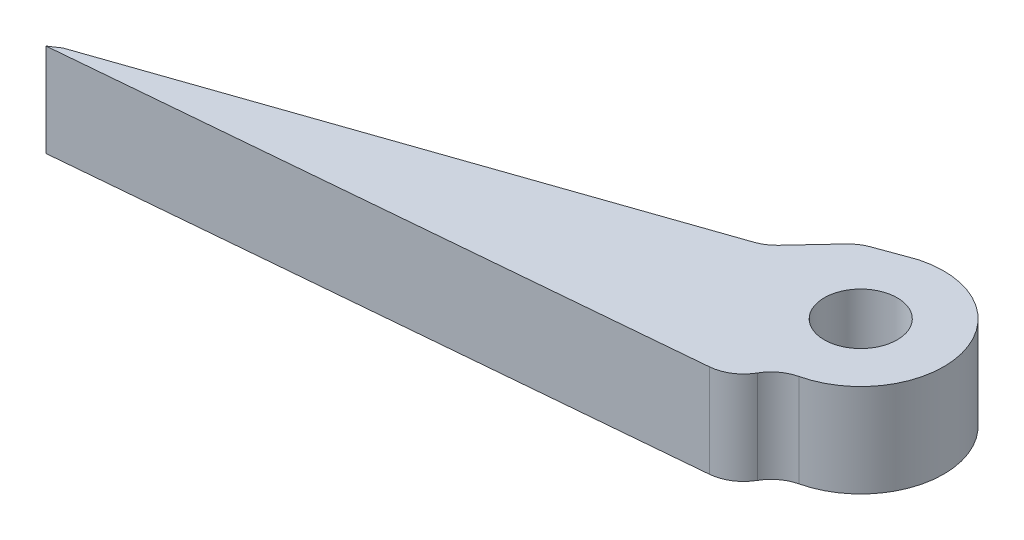
ISO-10303-21;
HEADER;
FILE_DESCRIPTION(('STEP AP214'),'2;1');
FILE_NAME('part.step','',(''),(''),'','','');
FILE_SCHEMA(('AUTOMOTIVE_DESIGN { 1 0 10303 214 1 1 1 1 }'));
ENDSEC;
DATA;
#1=APPLICATION_CONTEXT('core data for automotive mechanical design processes');
#2=APPLICATION_PROTOCOL_DEFINITION('international standard','automotive_design',2000,#1);
#3=PRODUCT_CONTEXT('',#1,'mechanical');
#4=PRODUCT('Part','Part','',(#3));
#5=PRODUCT_RELATED_PRODUCT_CATEGORY('part','',(#4));
#6=PRODUCT_DEFINITION_FORMATION('','',#4);
#7=PRODUCT_DEFINITION_CONTEXT('part definition',#1,'design');
#8=PRODUCT_DEFINITION('design','',#6,#7);
#9=PRODUCT_DEFINITION_SHAPE('','',#8);
#10=(LENGTH_UNIT() NAMED_UNIT(*) SI_UNIT(.MILLI.,.METRE.));
#11=(NAMED_UNIT(*) PLANE_ANGLE_UNIT() SI_UNIT($,.RADIAN.));
#12=(NAMED_UNIT(*) SI_UNIT($,.STERADIAN.) SOLID_ANGLE_UNIT());
#13=UNCERTAINTY_MEASURE_WITH_UNIT(LENGTH_MEASURE(1.E-05),#10,'distance_accuracy_value','');
#14=(GEOMETRIC_REPRESENTATION_CONTEXT(3) GLOBAL_UNCERTAINTY_ASSIGNED_CONTEXT((#13)) GLOBAL_UNIT_ASSIGNED_CONTEXT((#10,
#11,#12)) REPRESENTATION_CONTEXT('',''));
#15=CARTESIAN_POINT('',(0.,0.,0.));
#16=DIRECTION('',(0.,0.,1.));
#17=DIRECTION('',(1.,0.,0.));
#18=AXIS2_PLACEMENT_3D('',#15,#16,#17);
#19=CARTESIAN_POINT('',(0.,6.35,0.));
#20=DIRECTION('',(0.,-1.,0.));
#21=DIRECTION('',(0.,0.,-1.));
#22=AXIS2_PLACEMENT_3D('',#19,#20,#21);
#23=CYLINDRICAL_SURFACE('',#22,5.6642);
#24=CARTESIAN_POINT('',(0.,6.35,0.));
#25=DIRECTION('',(0.,1.,0.));
#26=DIRECTION('',(0.,0.,1.));
#27=AXIS2_PLACEMENT_3D('',#24,#25,#26);
#28=CIRCLE('',#27,5.6642);
#29=CARTESIAN_POINT('',(1.29689508505912,6.35,5.51373056816793));
#30=VERTEX_POINT('',#29);
#31=CARTESIAN_POINT('',(-1.48078407813982,6.35,-5.46721502722616));
#32=VERTEX_POINT('',#31);
#33=EDGE_CURVE('E173',#30,#32,#28,.T.);
#34=ORIENTED_EDGE('',*,*,#33,.F.);
#35=DIRECTION('',(0.,-1.,0.));
#36=VECTOR('',#35,1.);
#37=CARTESIAN_POINT('',(1.29689508505912,6.35,5.51373056816793));
#38=LINE('',#37,#36);
#39=CARTESIAN_POINT('',(1.29689508505912,0.,5.51373056816793));
#40=VERTEX_POINT('',#39);
#41=EDGE_CURVE('E207',#30,#40,#38,.T.);
#42=ORIENTED_EDGE('',*,*,#41,.T.);
#43=CARTESIAN_POINT('',(0.,0.,0.));
#44=DIRECTION('',(0.,1.,0.));
#45=DIRECTION('',(0.,0.,1.));
#46=AXIS2_PLACEMENT_3D('',#43,#44,#45);
#47=CIRCLE('',#46,5.6642);
#48=CARTESIAN_POINT('',(-1.48078407813982,0.,-5.46721502722616));
#49=VERTEX_POINT('',#48);
#50=EDGE_CURVE('E156',#40,#49,#47,.T.);
#51=ORIENTED_EDGE('',*,*,#50,.T.);
#52=DIRECTION('',(0.,-1.,0.));
#53=VECTOR('',#52,1.);
#54=CARTESIAN_POINT('',(-1.48078407813982,6.35,-5.46721502722616));
#55=LINE('',#54,#53);
#56=EDGE_CURVE('E194',#49,#32,#55,.F.);
#57=ORIENTED_EDGE('',*,*,#56,.T.);
#58=EDGE_LOOP('',(#34,#42,#51,#57));
#59=FACE_BOUND('',#58,.T.);
#60=ADVANCED_FACE('F38',(#59),#23,.T.);
#61=CARTESIAN_POINT('',(-1.93832585993717,6.35,-5.31007611663692));
#62=DIRECTION('',(0.342897302873058,0.,0.939372897034177));
#63=DIRECTION('',(0.939372897034177,0.,-0.342897302873058));
#64=AXIS2_PLACEMENT_3D('',#61,#62,#63);
#65=PLANE('',#64);
#66=DIRECTION('',(-0.939372897034177,0.,0.342897302873058));
#67=VECTOR('',#66,1.);
#68=CARTESIAN_POINT('',(-1.93832585993717,6.35,-5.31007611663692));
#69=LINE('',#68,#67);
#70=CARTESIAN_POINT('',(-1.68771449284554,6.35,-5.40155625420142));
#71=VERTEX_POINT('',#70);
#72=CARTESIAN_POINT('',(-3.93136501602205,6.35,-4.58256124655755));
#73=VERTEX_POINT('',#72);
#74=EDGE_CURVE('E225',#71,#73,#69,.T.);
#75=ORIENTED_EDGE('',*,*,#74,.F.);
#76=DIRECTION('',(0.,-1.,0.));
#77=VECTOR('',#76,1.);
#78=CARTESIAN_POINT('',(-1.68771449284554,6.35,-5.40155625420142));
#79=LINE('',#78,#77);
#80=CARTESIAN_POINT('',(-1.68771449284554,0.,-5.40155625420142));
#81=VERTEX_POINT('',#80);
#82=EDGE_CURVE('E191',#71,#81,#79,.T.);
#83=ORIENTED_EDGE('',*,*,#82,.T.);
#84=DIRECTION('',(-0.939372897034177,0.,0.342897302873058));
#85=VECTOR('',#84,1.);
#86=CARTESIAN_POINT('',(-1.93832585993717,0.,-5.31007611663692));
#87=LINE('',#86,#85);
#88=CARTESIAN_POINT('',(-3.93136501602205,0.,-4.58256124655755));
#89=VERTEX_POINT('',#88);
#90=EDGE_CURVE('E158',#81,#89,#87,.T.);
#91=ORIENTED_EDGE('',*,*,#90,.T.);
#92=DIRECTION('',(0.,-1.,0.));
#93=VECTOR('',#92,1.);
#94=CARTESIAN_POINT('',(-3.93136501602205,6.35,-4.58256124655755));
#95=LINE('',#94,#93);
#96=EDGE_CURVE('E189',#89,#73,#95,.F.);
#97=ORIENTED_EDGE('',*,*,#96,.T.);
#98=EDGE_LOOP('',(#75,#83,#91,#97));
#99=FACE_BOUND('',#98,.T.);
#100=ADVANCED_FACE('F228',(#99),#65,.F.);
#101=CARTESIAN_POINT('',(-4.58967507965529,6.35,-4.28088514702107));
#102=DIRECTION('',(0.731278684400195,0.,0.682078797311514));
#103=DIRECTION('',(0.682078797311514,0.,-0.731278684400195));
#104=AXIS2_PLACEMENT_3D('',#101,#102,#103);
#105=PLANE('',#104);
#106=DIRECTION('',(-0.682078797311514,0.,0.731278684400195));
#107=VECTOR('',#106,1.);
#108=CARTESIAN_POINT('',(-4.58967507965529,6.35,-4.28088514702107));
#109=LINE('',#108,#107);
#110=CARTESIAN_POINT('',(-4.91785372510097,6.35,-3.92903423326198));
#111=VERTEX_POINT('',#110);
#112=CARTESIAN_POINT('',(-7.13490656472734,6.35,-1.55206035546642));
#113=VERTEX_POINT('',#112);
#114=EDGE_CURVE('E133',#111,#113,#109,.T.);
#115=ORIENTED_EDGE('',*,*,#114,.F.);
#116=DIRECTION('',(0.,-1.,0.));
#117=VECTOR('',#116,1.);
#118=CARTESIAN_POINT('',(-4.91785372510097,6.35,-3.92903423326198));
#119=LINE('',#118,#117);
#120=CARTESIAN_POINT('',(-4.91785372510097,0.,-3.92903423326198));
#121=VERTEX_POINT('',#120);
#122=EDGE_CURVE('E199',#111,#121,#119,.T.);
#123=ORIENTED_EDGE('',*,*,#122,.T.);
#124=DIRECTION('',(-0.682078797311514,0.,0.731278684400195));
#125=VECTOR('',#124,1.);
#126=CARTESIAN_POINT('',(-4.58967507965529,0.,-4.28088514702107));
#127=LINE('',#126,#125);
#128=CARTESIAN_POINT('',(-7.13490656472734,0.,-1.55206035546642));
#129=VERTEX_POINT('',#128);
#130=EDGE_CURVE('E161',#121,#129,#127,.T.);
#131=ORIENTED_EDGE('',*,*,#130,.T.);
#132=DIRECTION('',(0.,-1.,0.));
#133=VECTOR('',#132,1.);
#134=CARTESIAN_POINT('',(-7.13490656472734,6.35,-1.55206035546642));
#135=LINE('',#134,#133);
#136=EDGE_CURVE('E197',#129,#113,#135,.F.);
#137=ORIENTED_EDGE('',*,*,#136,.T.);
#138=EDGE_LOOP('',(#115,#123,#131,#137));
#139=FACE_BOUND('',#138,.T.);
#140=ADVANCED_FACE('F254',(#139),#105,.F.);
#141=CARTESIAN_POINT('',(-1.14127849340694,6.35,-3.3070118596416));
#142=DIRECTION('',(0.326228149845985,0.,0.945291063243521));
#143=DIRECTION('',(0.945291063243521,0.,-0.326228149845985));
#144=AXIS2_PLACEMENT_3D('',#141,#142,#143);
#145=PLANE('',#144);
#146=DIRECTION('',(-0.945291063243521,0.,0.326228149845985));
#147=VECTOR('',#146,1.);
#148=CARTESIAN_POINT('',(-1.14127849340694,6.35,-3.3070118596416));
#149=LINE('',#148,#147);
#150=CARTESIAN_POINT('',(-8.16373492249503,6.35,-0.88350119999912));
#151=VERTEX_POINT('',#150);
#152=CARTESIAN_POINT('',(-43.2087752257035,6.35,11.2108463548856));
#153=VERTEX_POINT('',#152);
#154=EDGE_CURVE('E119',#151,#153,#149,.T.);
#155=ORIENTED_EDGE('',*,*,#154,.F.);
#156=DIRECTION('',(0.,-1.,0.));
#157=VECTOR('',#156,1.);
#158=CARTESIAN_POINT('',(-8.16373492249503,0.,-0.883501199999119));
#159=LINE('',#158,#157);
#160=CARTESIAN_POINT('',(-8.16373492249503,0.,-0.88350119999912));
#161=VERTEX_POINT('',#160);
#162=EDGE_CURVE('E202',#151,#161,#159,.T.);
#163=ORIENTED_EDGE('',*,*,#162,.T.);
#164=DIRECTION('',(-0.945291063243521,0.,0.326228149845985));
#165=VECTOR('',#164,1.);
#166=CARTESIAN_POINT('',(-1.14127849340694,0.,-3.3070118596416));
#167=LINE('',#166,#165);
#168=CARTESIAN_POINT('',(-43.2087752257035,0.,11.2108463548856));
#169=VERTEX_POINT('',#168);
#170=EDGE_CURVE('E139',#161,#169,#167,.T.);
#171=ORIENTED_EDGE('',*,*,#170,.T.);
#172=DIRECTION('',(0.,-1.,0.));
#173=VECTOR('',#172,1.);
#174=CARTESIAN_POINT('',(-43.2087752257035,6.35,11.2108463548856));
#175=LINE('',#174,#173);
#176=EDGE_CURVE('E136',#153,#169,#175,.T.);
#177=ORIENTED_EDGE('',*,*,#176,.F.);
#178=EDGE_LOOP('',(#155,#163,#171,#177));
#179=FACE_BOUND('',#178,.T.);
#180=ADVANCED_FACE('F137',(#179),#145,.F.);
#181=CARTESIAN_POINT('',(-8.12479474790291,6.35,-12.1842060856918));
#182=DIRECTION('',(0.554794299812511,0.,0.831987550925821));
#183=DIRECTION('',(0.831987550925821,0.,-0.554794299812511));
#184=AXIS2_PLACEMENT_3D('',#181,#182,#183);
#185=PLANE('',#184);
#186=DIRECTION('',(-0.831987550925821,0.,0.554794299812511));
#187=VECTOR('',#186,1.);
#188=CARTESIAN_POINT('',(-8.12479474790291,0.,-12.1842060856918));
#189=LINE('',#188,#187);
#190=CARTESIAN_POINT('',(-43.9079976591394,0.,11.6771088848232));
#191=VERTEX_POINT('',#190);
#192=EDGE_CURVE('E165',#169,#191,#189,.T.);
#193=ORIENTED_EDGE('',*,*,#192,.T.);
#194=DIRECTION('',(0.,-1.,0.));
#195=VECTOR('',#194,1.);
#196=CARTESIAN_POINT('',(-43.9079976591394,6.35,11.6771088848232));
#197=LINE('',#196,#195);
#198=CARTESIAN_POINT('',(-43.9079976591394,6.35,11.6771088848232));
#199=VERTEX_POINT('',#198);
#200=EDGE_CURVE('E143',#199,#191,#197,.T.);
#201=ORIENTED_EDGE('',*,*,#200,.F.);
#202=DIRECTION('',(-0.831987550925821,0.,0.554794299812511));
#203=VECTOR('',#202,1.);
#204=CARTESIAN_POINT('',(-8.12479474790291,6.35,-12.1842060856918));
#205=LINE('',#204,#203);
#206=EDGE_CURVE('E125',#153,#199,#205,.T.);
#207=ORIENTED_EDGE('',*,*,#206,.F.);
#208=ORIENTED_EDGE('',*,*,#176,.T.);
#209=EDGE_LOOP('',(#193,#201,#207,#208));
#210=FACE_BOUND('',#209,.T.);
#211=ADVANCED_FACE('F145',(#210),#185,.F.);
#212=CARTESIAN_POINT('',(0.684121339297338,6.35,7.73125035187185));
#213=DIRECTION('',(-0.0881433880829443,0.,-0.996107796946324));
#214=DIRECTION('',(-0.996107796946324,0.,0.0881433880829443));
#215=AXIS2_PLACEMENT_3D('',#212,#213,#214);
#216=PLANE('',#215);
#217=DIRECTION('',(0.996107796946324,0.,-0.0881433880829443));
#218=VECTOR('',#217,1.);
#219=CARTESIAN_POINT('',(0.684121339297338,0.,7.73125035187185));
#220=LINE('',#219,#218);
#221=CARTESIAN_POINT('',(-2.30836599064848,0.,7.99604897393396));
#222=VERTEX_POINT('',#221);
#223=EDGE_CURVE('E167',#191,#222,#220,.T.);
#224=ORIENTED_EDGE('',*,*,#223,.T.);
#225=DIRECTION('',(0.,-1.,0.));
#226=VECTOR('',#225,1.);
#227=CARTESIAN_POINT('',(-2.30836599064848,6.35,7.99604897393396));
#228=LINE('',#227,#226);
#229=CARTESIAN_POINT('',(-2.30836599064848,6.35,7.99604897393396));
#230=VERTEX_POINT('',#229);
#231=EDGE_CURVE('E181',#222,#230,#228,.F.);
#232=ORIENTED_EDGE('',*,*,#231,.T.);
#233=DIRECTION('',(0.996107796946324,0.,-0.0881433880829443));
#234=VECTOR('',#233,1.);
#235=CARTESIAN_POINT('',(0.684121339297338,6.35,7.73125035187185));
#236=LINE('',#235,#234);
#237=EDGE_CURVE('E148',#199,#230,#236,.T.);
#238=ORIENTED_EDGE('',*,*,#237,.F.);
#239=ORIENTED_EDGE('',*,*,#200,.T.);
#240=EDGE_LOOP('',(#224,#232,#238,#239));
#241=FACE_BOUND('',#240,.T.);
#242=ADVANCED_FACE('F241',(#241),#216,.F.);
#243=CARTESIAN_POINT('',(0.,6.35,0.));
#244=DIRECTION('',(0.,-1.,0.));
#245=DIRECTION('',(0.,0.,-1.));
#246=AXIS2_PLACEMENT_3D('',#243,#244,#245);
#247=CYLINDRICAL_SURFACE('',#246,2.4892);
#248=CARTESIAN_POINT('',(0.,6.35,0.));
#249=DIRECTION('',(0.,1.,0.));
#250=DIRECTION('',(0.,0.,1.));
#251=AXIS2_PLACEMENT_3D('',#248,#249,#250);
#252=CIRCLE('',#251,2.4892);
#253=CARTESIAN_POINT('',(0.,6.35,2.4892));
#254=VERTEX_POINT('',#253);
#255=EDGE_CURVE('E150',#254,#254,#252,.T.);
#256=ORIENTED_EDGE('',*,*,#255,.T.);
#257=EDGE_LOOP('',(#256));
#258=FACE_BOUND('',#257,.T.);
#259=CARTESIAN_POINT('',(0.,0.,0.));
#260=DIRECTION('',(0.,1.,0.));
#261=DIRECTION('',(0.,0.,1.));
#262=AXIS2_PLACEMENT_3D('',#259,#260,#261);
#263=CIRCLE('',#262,2.4892);
#264=CARTESIAN_POINT('',(0.,0.,2.4892));
#265=VERTEX_POINT('',#264);
#266=EDGE_CURVE('E170',#265,#265,#263,.T.);
#267=ORIENTED_EDGE('',*,*,#266,.F.);
#268=EDGE_LOOP('',(#267));
#269=FACE_BOUND('',#268,.T.);
#270=ADVANCED_FACE('F276',(#258,#269),#247,.F.);
#271=CARTESIAN_POINT('',(0.,6.35,0.));
#272=DIRECTION('',(0.,1.,0.));
#273=DIRECTION('',(0.,0.,1.));
#274=AXIS2_PLACEMENT_3D('',#271,#272,#273);
#275=PLANE('',#274);
#276=ORIENTED_EDGE('',*,*,#237,.T.);
#277=CARTESIAN_POINT('',(-2.53225019637915,6.35,5.46593516969029));
#278=DIRECTION('',(0.,1.,0.));
#279=DIRECTION('',(0.,0.,1.));
#280=AXIS2_PLACEMENT_3D('',#277,#278,#279);
#281=CIRCLE('',#280,2.54);
#282=CARTESIAN_POINT('',(-0.326893904301469,6.35,6.72609532815959));
#283=VERTEX_POINT('',#282);
#284=EDGE_CURVE('E187',#230,#283,#281,.T.);
#285=ORIENTED_EDGE('',*,*,#284,.T.);
#286=CARTESIAN_POINT('',(1.87846238777622,6.35,7.98625548662889));
#287=DIRECTION('',(0.,1.,0.));
#288=DIRECTION('',(0.,0.,1.));
#289=AXIS2_PLACEMENT_3D('',#286,#287,#288);
#290=CIRCLE('',#289,2.54);
#291=EDGE_CURVE('E11',#283,#30,#290,.F.);
#292=ORIENTED_EDGE('',*,*,#291,.T.);
#293=ORIENTED_EDGE('',*,*,#33,.T.);
#294=CARTESIAN_POINT('',(-0.816755343547975,6.35,-3.01554909573461));
#295=DIRECTION('',(0.,1.,0.));
#296=DIRECTION('',(0.,0.,1.));
#297=AXIS2_PLACEMENT_3D('',#294,#295,#296);
#298=CIRCLE('',#297,2.54);
#299=EDGE_CURVE('E185',#32,#71,#298,.T.);
#300=ORIENTED_EDGE('',*,*,#299,.T.);
#301=ORIENTED_EDGE('',*,*,#74,.T.);
#302=CARTESIAN_POINT('',(-3.06040586672448,6.35,-2.19655408809074));
#303=DIRECTION('',(0.,1.,0.));
#304=DIRECTION('',(0.,0.,1.));
#305=AXIS2_PLACEMENT_3D('',#302,#303,#304);
#306=CIRCLE('',#305,2.54);
#307=EDGE_CURVE('E183',#73,#111,#306,.T.);
#308=ORIENTED_EDGE('',*,*,#307,.T.);
#309=ORIENTED_EDGE('',*,*,#114,.T.);
#310=CARTESIAN_POINT('',(-8.99235442310383,6.35,-3.28454050063766));
#311=DIRECTION('',(0.,1.,0.));
#312=DIRECTION('',(0.,0.,1.));
#313=AXIS2_PLACEMENT_3D('',#310,#311,#312);
#314=CIRCLE('',#313,2.54);
#315=EDGE_CURVE('E129',#113,#151,#314,.F.);
#316=ORIENTED_EDGE('',*,*,#315,.T.);
#317=ORIENTED_EDGE('',*,*,#154,.T.);
#318=ORIENTED_EDGE('',*,*,#206,.T.);
#319=EDGE_LOOP('',(#276,#285,#292,#293,#300,#301,#308,#309,#316,#317,#318));
#320=FACE_BOUND('',#319,.T.);
#321=ORIENTED_EDGE('',*,*,#255,.F.);
#322=EDGE_LOOP('',(#321));
#323=FACE_BOUND('',#322,.T.);
#324=ADVANCED_FACE('F122',(#320,#323),#275,.T.);
#325=CARTESIAN_POINT('',(0.,0.,0.));
#326=DIRECTION('',(0.,1.,0.));
#327=DIRECTION('',(0.,0.,1.));
#328=AXIS2_PLACEMENT_3D('',#325,#326,#327);
#329=PLANE('',#328);
#330=ORIENTED_EDGE('',*,*,#50,.F.);
#331=CARTESIAN_POINT('',(1.87846238777622,0.,7.98625548662889));
#332=DIRECTION('',(0.,1.,0.));
#333=DIRECTION('',(0.,0.,1.));
#334=AXIS2_PLACEMENT_3D('',#331,#332,#333);
#335=CIRCLE('',#334,2.54);
#336=CARTESIAN_POINT('',(-0.326893904301469,0.,6.72609532815959));
#337=VERTEX_POINT('',#336);
#338=EDGE_CURVE('E46',#40,#337,#335,.T.);
#339=ORIENTED_EDGE('',*,*,#338,.T.);
#340=CARTESIAN_POINT('',(-2.53225019637915,0.,5.46593516969029));
#341=DIRECTION('',(0.,1.,0.));
#342=DIRECTION('',(0.,0.,1.));
#343=AXIS2_PLACEMENT_3D('',#340,#341,#342);
#344=CIRCLE('',#343,2.54);
#345=EDGE_CURVE('E179',#337,#222,#344,.F.);
#346=ORIENTED_EDGE('',*,*,#345,.T.);
#347=ORIENTED_EDGE('',*,*,#223,.F.);
#348=ORIENTED_EDGE('',*,*,#192,.F.);
#349=ORIENTED_EDGE('',*,*,#170,.F.);
#350=CARTESIAN_POINT('',(-8.99235442310383,0.,-3.28454050063766));
#351=DIRECTION('',(0.,1.,0.));
#352=DIRECTION('',(0.,0.,1.));
#353=AXIS2_PLACEMENT_3D('',#350,#351,#352);
#354=CIRCLE('',#353,2.54);
#355=EDGE_CURVE('E204',#161,#129,#354,.T.);
#356=ORIENTED_EDGE('',*,*,#355,.T.);
#357=ORIENTED_EDGE('',*,*,#130,.F.);
#358=CARTESIAN_POINT('',(-3.06040586672448,0.,-2.19655408809074));
#359=DIRECTION('',(0.,1.,0.));
#360=DIRECTION('',(0.,0.,1.));
#361=AXIS2_PLACEMENT_3D('',#358,#359,#360);
#362=CIRCLE('',#361,2.54);
#363=EDGE_CURVE('E142',#121,#89,#362,.F.);
#364=ORIENTED_EDGE('',*,*,#363,.T.);
#365=ORIENTED_EDGE('',*,*,#90,.F.);
#366=CARTESIAN_POINT('',(-0.816755343547975,0.,-3.01554909573461));
#367=DIRECTION('',(0.,1.,0.));
#368=DIRECTION('',(0.,0.,1.));
#369=AXIS2_PLACEMENT_3D('',#366,#367,#368);
#370=CIRCLE('',#369,2.54);
#371=EDGE_CURVE('E176',#81,#49,#370,.F.);
#372=ORIENTED_EDGE('',*,*,#371,.T.);
#373=EDGE_LOOP('',(#330,#339,#346,#347,#348,#349,#356,#357,#364,#365,#372));
#374=FACE_BOUND('',#373,.T.);
#375=ORIENTED_EDGE('',*,*,#266,.T.);
#376=EDGE_LOOP('',(#375));
#377=FACE_BOUND('',#376,.T.);
#378=ADVANCED_FACE('F215',(#374,#377),#329,.F.);
#379=CARTESIAN_POINT('',(-2.53225019637915,6.35,5.46593516969029));
#380=DIRECTION('',(0.,-1.,0.));
#381=DIRECTION('',(0.,0.,-1.));
#382=AXIS2_PLACEMENT_3D('',#379,#380,#381);
#383=CYLINDRICAL_SURFACE('',#382,2.54);
#384=ORIENTED_EDGE('',*,*,#345,.F.);
#385=DIRECTION('',(0.,-1.,0.));
#386=VECTOR('',#385,1.);
#387=CARTESIAN_POINT('',(-0.326893904301469,6.35,6.72609532815959));
#388=LINE('',#387,#386);
#389=EDGE_CURVE('E59',#337,#283,#388,.F.);
#390=ORIENTED_EDGE('',*,*,#389,.T.);
#391=ORIENTED_EDGE('',*,*,#284,.F.);
#392=ORIENTED_EDGE('',*,*,#231,.F.);
#393=EDGE_LOOP('',(#384,#390,#391,#392));
#394=FACE_BOUND('',#393,.T.);
#395=ADVANCED_FACE('F243',(#394),#383,.T.);
#396=CARTESIAN_POINT('',(-0.816755343547975,6.35,-3.01554909573461));
#397=DIRECTION('',(0.,-1.,0.));
#398=DIRECTION('',(0.,0.,-1.));
#399=AXIS2_PLACEMENT_3D('',#396,#397,#398);
#400=CYLINDRICAL_SURFACE('',#399,2.54);
#401=ORIENTED_EDGE('',*,*,#299,.F.);
#402=ORIENTED_EDGE('',*,*,#56,.F.);
#403=ORIENTED_EDGE('',*,*,#371,.F.);
#404=ORIENTED_EDGE('',*,*,#82,.F.);
#405=EDGE_LOOP('',(#401,#402,#403,#404));
#406=FACE_BOUND('',#405,.T.);
#407=ADVANCED_FACE('F222',(#406),#400,.T.);
#408=CARTESIAN_POINT('',(-3.06040586672448,6.35,-2.19655408809074));
#409=DIRECTION('',(0.,-1.,0.));
#410=DIRECTION('',(0.,0.,-1.));
#411=AXIS2_PLACEMENT_3D('',#408,#409,#410);
#412=CYLINDRICAL_SURFACE('',#411,2.54);
#413=ORIENTED_EDGE('',*,*,#307,.F.);
#414=ORIENTED_EDGE('',*,*,#96,.F.);
#415=ORIENTED_EDGE('',*,*,#363,.F.);
#416=ORIENTED_EDGE('',*,*,#122,.F.);
#417=EDGE_LOOP('',(#413,#414,#415,#416));
#418=FACE_BOUND('',#417,.T.);
#419=ADVANCED_FACE('F248',(#418),#412,.T.);
#420=CARTESIAN_POINT('',(-8.99235442310383,6.35,-3.28454050063766));
#421=DIRECTION('',(0.,1.,0.));
#422=DIRECTION('',(0.,0.,1.));
#423=AXIS2_PLACEMENT_3D('',#420,#421,#422);
#424=CYLINDRICAL_SURFACE('',#423,2.54);
#425=ORIENTED_EDGE('',*,*,#315,.F.);
#426=ORIENTED_EDGE('',*,*,#136,.F.);
#427=ORIENTED_EDGE('',*,*,#355,.F.);
#428=ORIENTED_EDGE('',*,*,#162,.F.);
#429=EDGE_LOOP('',(#425,#426,#427,#428));
#430=FACE_BOUND('',#429,.T.);
#431=ADVANCED_FACE('F237',(#430),#424,.F.);
#432=CARTESIAN_POINT('',(1.87846238777622,6.35,7.98625548662889));
#433=DIRECTION('',(0.,1.,0.));
#434=DIRECTION('',(0.,0.,1.));
#435=AXIS2_PLACEMENT_3D('',#432,#433,#434);
#436=CYLINDRICAL_SURFACE('',#435,2.54);
#437=ORIENTED_EDGE('',*,*,#291,.F.);
#438=ORIENTED_EDGE('',*,*,#389,.F.);
#439=ORIENTED_EDGE('',*,*,#338,.F.);
#440=ORIENTED_EDGE('',*,*,#41,.F.);
#441=EDGE_LOOP('',(#437,#438,#439,#440));
#442=FACE_BOUND('',#441,.T.);
#443=ADVANCED_FACE('F40',(#442),#436,.F.);
#444=CLOSED_SHELL('',(#60,#100,#140,#180,#211,#242,#270,#324,#378,#395,#407,#419,#431,#443));
#445=MANIFOLD_SOLID_BREP('B2',#444);
#446=ADVANCED_BREP_SHAPE_REPRESENTATION('',(#18,#445),#14);
#447=SHAPE_DEFINITION_REPRESENTATION(#9,#446);
ENDSEC;
END-ISO-10303-21;
